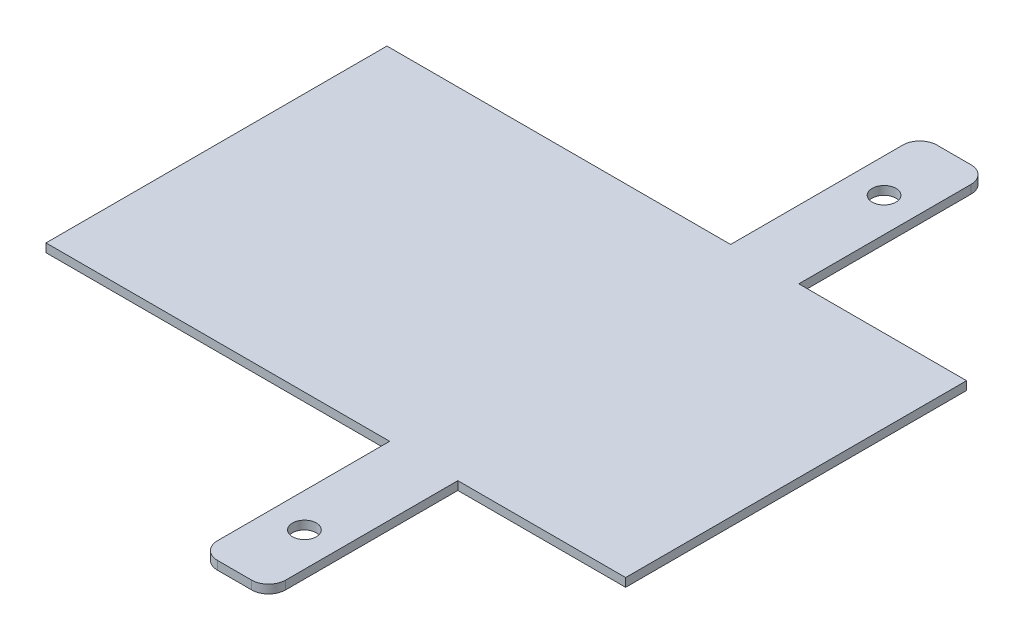
ISO-10303-21;
HEADER;
FILE_DESCRIPTION(('STEP AP214'),'2;1');
FILE_NAME('part.step','',(''),(''),'','','');
FILE_SCHEMA(('AUTOMOTIVE_DESIGN { 1 0 10303 214 1 1 1 1 }'));
ENDSEC;
DATA;
#1=APPLICATION_CONTEXT('core data for automotive mechanical design processes');
#2=APPLICATION_PROTOCOL_DEFINITION('international standard','automotive_design',2000,#1);
#3=PRODUCT_CONTEXT('',#1,'mechanical');
#4=PRODUCT('Part','Part','',(#3));
#5=PRODUCT_RELATED_PRODUCT_CATEGORY('part','',(#4));
#6=PRODUCT_DEFINITION_FORMATION('','',#4);
#7=PRODUCT_DEFINITION_CONTEXT('part definition',#1,'design');
#8=PRODUCT_DEFINITION('design','',#6,#7);
#9=PRODUCT_DEFINITION_SHAPE('','',#8);
#10=(LENGTH_UNIT() NAMED_UNIT(*) SI_UNIT(.MILLI.,.METRE.));
#11=(NAMED_UNIT(*) PLANE_ANGLE_UNIT() SI_UNIT($,.RADIAN.));
#12=(NAMED_UNIT(*) SI_UNIT($,.STERADIAN.) SOLID_ANGLE_UNIT());
#13=UNCERTAINTY_MEASURE_WITH_UNIT(LENGTH_MEASURE(1.E-05),#10,'distance_accuracy_value','');
#14=(GEOMETRIC_REPRESENTATION_CONTEXT(3) GLOBAL_UNCERTAINTY_ASSIGNED_CONTEXT((#13)) GLOBAL_UNIT_ASSIGNED_CONTEXT((#10,
#11,#12)) REPRESENTATION_CONTEXT('',''));
#15=CARTESIAN_POINT('',(0.,0.,0.));
#16=DIRECTION('',(0.,0.,1.));
#17=DIRECTION('',(1.,0.,0.));
#18=AXIS2_PLACEMENT_3D('',#15,#16,#17);
#19=CARTESIAN_POINT('',(-479.708642175763,5.,-121.631578947368));
#20=DIRECTION('',(0.,1.,0.));
#21=DIRECTION('',(0.,0.,1.));
#22=AXIS2_PLACEMENT_3D('',#19,#20,#21);
#23=PLANE('',#22);
#24=CARTESIAN_POINT('',(-469.708642175763,5.,-492.631578947368));
#25=DIRECTION('',(0.,1.,0.));
#26=DIRECTION('',(0.,0.,1.));
#27=AXIS2_PLACEMENT_3D('',#24,#25,#26);
#28=CIRCLE('',#27,6.99999999999999);
#29=CARTESIAN_POINT('',(-469.708642175763,5.,-485.631578947368));
#30=VERTEX_POINT('',#29);
#31=EDGE_CURVE('E187',#30,#30,#28,.T.);
#32=ORIENTED_EDGE('',*,*,#31,.F.);
#33=EDGE_LOOP('',(#32));
#34=FACE_BOUND('',#33,.T.);
#35=DIRECTION('',(0.,0.,1.));
#36=VECTOR('',#35,1.);
#37=CARTESIAN_POINT('',(-691.29647542446,5.,-422.631578947368));
#38=LINE('',#37,#36);
#39=CARTESIAN_POINT('',(-691.29647542446,5.,-422.631578947368));
#40=VERTEX_POINT('',#39);
#41=CARTESIAN_POINT('',(-691.29647542446,5.,-222.631578947368));
#42=VERTEX_POINT('',#41);
#43=EDGE_CURVE('E214',#40,#42,#38,.T.);
#44=ORIENTED_EDGE('',*,*,#43,.T.);
#45=DIRECTION('',(1.,0.,0.));
#46=VECTOR('',#45,1.);
#47=CARTESIAN_POINT('',(-691.29647542446,5.,-222.631578947368));
#48=LINE('',#47,#46);
#49=CARTESIAN_POINT('',(-489.708642175763,5.,-222.631578947368));
#50=VERTEX_POINT('',#49);
#51=EDGE_CURVE('E122',#42,#50,#48,.T.);
#52=ORIENTED_EDGE('',*,*,#51,.T.);
#53=DIRECTION('',(0.,0.,1.));
#54=VECTOR('',#53,1.);
#55=CARTESIAN_POINT('',(-489.708642175763,5.,-222.631578947368));
#56=LINE('',#55,#54);
#57=CARTESIAN_POINT('',(-489.708642175763,5.,-121.631578947368));
#58=VERTEX_POINT('',#57);
#59=EDGE_CURVE('E253',#50,#58,#56,.T.);
#60=ORIENTED_EDGE('',*,*,#59,.T.);
#61=CARTESIAN_POINT('',(-479.708642175763,5.,-121.631578947368));
#62=DIRECTION('',(0.,1.,0.));
#63=DIRECTION('',(0.,0.,1.));
#64=AXIS2_PLACEMENT_3D('',#61,#62,#63);
#65=CIRCLE('',#64,10.);
#66=CARTESIAN_POINT('',(-479.708642175763,5.,-111.631578947368));
#67=VERTEX_POINT('',#66);
#68=EDGE_CURVE('E272',#58,#67,#65,.T.);
#69=ORIENTED_EDGE('',*,*,#68,.T.);
#70=DIRECTION('',(1.,0.,0.));
#71=VECTOR('',#70,1.);
#72=CARTESIAN_POINT('',(-479.708642175763,5.,-111.631578947368));
#73=LINE('',#72,#71);
#74=CARTESIAN_POINT('',(-459.708642175763,5.,-111.631578947369));
#75=VERTEX_POINT('',#74);
#76=EDGE_CURVE('E269',#67,#75,#73,.T.);
#77=ORIENTED_EDGE('',*,*,#76,.T.);
#78=CARTESIAN_POINT('',(-459.708642175763,5.,-121.631578947369));
#79=DIRECTION('',(0.,1.,0.));
#80=DIRECTION('',(0.,0.,1.));
#81=AXIS2_PLACEMENT_3D('',#78,#79,#80);
#82=CIRCLE('',#81,10.);
#83=CARTESIAN_POINT('',(-449.708642175763,5.,-121.631578947369));
#84=VERTEX_POINT('',#83);
#85=EDGE_CURVE('E271',#75,#84,#82,.T.);
#86=ORIENTED_EDGE('',*,*,#85,.T.);
#87=DIRECTION('',(0.,0.,-1.));
#88=VECTOR('',#87,1.);
#89=CARTESIAN_POINT('',(-449.708642175763,5.,-222.631578947368));
#90=LINE('',#89,#88);
#91=CARTESIAN_POINT('',(-449.708642175763,5.,-222.631578947368));
#92=VERTEX_POINT('',#91);
#93=EDGE_CURVE('E274',#84,#92,#90,.T.);
#94=ORIENTED_EDGE('',*,*,#93,.T.);
#95=DIRECTION('',(1.,0.,0.));
#96=VECTOR('',#95,1.);
#97=CARTESIAN_POINT('',(-449.708642175763,5.,-222.631578947368));
#98=LINE('',#97,#96);
#99=CARTESIAN_POINT('',(-351.29647542446,5.,-222.631578947368));
#100=VERTEX_POINT('',#99);
#101=EDGE_CURVE('E280',#92,#100,#98,.T.);
#102=ORIENTED_EDGE('',*,*,#101,.T.);
#103=DIRECTION('',(0.,0.,-1.));
#104=VECTOR('',#103,1.);
#105=CARTESIAN_POINT('',(-351.29647542446,5.,-422.631578947368));
#106=LINE('',#105,#104);
#107=CARTESIAN_POINT('',(-351.29647542446,5.,-422.631578947368));
#108=VERTEX_POINT('',#107);
#109=EDGE_CURVE('E282',#100,#108,#106,.T.);
#110=ORIENTED_EDGE('',*,*,#109,.T.);
#111=DIRECTION('',(-1.,0.,0.));
#112=VECTOR('',#111,1.);
#113=CARTESIAN_POINT('',(-449.708642175763,5.,-422.631578947368));
#114=LINE('',#113,#112);
#115=CARTESIAN_POINT('',(-449.708642175763,5.,-422.631578947368));
#116=VERTEX_POINT('',#115);
#117=EDGE_CURVE('E284',#108,#116,#114,.T.);
#118=ORIENTED_EDGE('',*,*,#117,.T.);
#119=DIRECTION('',(0.,0.,-1.));
#120=VECTOR('',#119,1.);
#121=CARTESIAN_POINT('',(-449.708642175763,5.,-422.631578947368));
#122=LINE('',#121,#120);
#123=CARTESIAN_POINT('',(-449.708642175763,5.,-523.631578947368));
#124=VERTEX_POINT('',#123);
#125=EDGE_CURVE('E286',#116,#124,#122,.T.);
#126=ORIENTED_EDGE('',*,*,#125,.T.);
#127=CARTESIAN_POINT('',(-459.708642175763,5.,-523.631578947368));
#128=DIRECTION('',(0.,1.,0.));
#129=DIRECTION('',(0.,0.,-1.));
#130=AXIS2_PLACEMENT_3D('',#127,#128,#129);
#131=CIRCLE('',#130,10.);
#132=CARTESIAN_POINT('',(-459.708642175763,5.,-533.631578947368));
#133=VERTEX_POINT('',#132);
#134=EDGE_CURVE('E288',#124,#133,#131,.T.);
#135=ORIENTED_EDGE('',*,*,#134,.T.);
#136=DIRECTION('',(-1.,0.,0.));
#137=VECTOR('',#136,1.);
#138=CARTESIAN_POINT('',(-479.708642175763,5.,-533.631578947368));
#139=LINE('',#138,#137);
#140=CARTESIAN_POINT('',(-479.708642175763,5.,-533.631578947368));
#141=VERTEX_POINT('',#140);
#142=EDGE_CURVE('E165',#133,#141,#139,.T.);
#143=ORIENTED_EDGE('',*,*,#142,.T.);
#144=CARTESIAN_POINT('',(-479.708642175763,5.,-523.631578947368));
#145=DIRECTION('',(0.,1.,0.));
#146=DIRECTION('',(0.,0.,-1.));
#147=AXIS2_PLACEMENT_3D('',#144,#145,#146);
#148=CIRCLE('',#147,10.);
#149=CARTESIAN_POINT('',(-489.708642175763,5.,-523.631578947368));
#150=VERTEX_POINT('',#149);
#151=EDGE_CURVE('E159',#141,#150,#148,.T.);
#152=ORIENTED_EDGE('',*,*,#151,.T.);
#153=DIRECTION('',(0.,0.,1.));
#154=VECTOR('',#153,1.);
#155=CARTESIAN_POINT('',(-489.708642175763,5.,-422.631578947368));
#156=LINE('',#155,#154);
#157=CARTESIAN_POINT('',(-489.708642175763,5.,-422.631578947368));
#158=VERTEX_POINT('',#157);
#159=EDGE_CURVE('E163',#150,#158,#156,.T.);
#160=ORIENTED_EDGE('',*,*,#159,.T.);
#161=DIRECTION('',(-1.,0.,0.));
#162=VECTOR('',#161,1.);
#163=CARTESIAN_POINT('',(-691.29647542446,5.,-422.631578947368));
#164=LINE('',#163,#162);
#165=EDGE_CURVE('E55',#158,#40,#164,.T.);
#166=ORIENTED_EDGE('',*,*,#165,.T.);
#167=EDGE_LOOP('',(#44,#52,#60,#69,#77,#86,#94,#102,#110,#118,#126,#135,#143,#152,#160,#166));
#168=FACE_BOUND('',#167,.T.);
#169=CARTESIAN_POINT('',(-469.708642175763,5.,-152.631578947368));
#170=DIRECTION('',(0.,1.,0.));
#171=DIRECTION('',(0.,0.,1.));
#172=AXIS2_PLACEMENT_3D('',#169,#170,#171);
#173=CIRCLE('',#172,6.99999999999999);
#174=CARTESIAN_POINT('',(-469.708642175763,5.,-145.631578947368));
#175=VERTEX_POINT('',#174);
#176=EDGE_CURVE('E330',#175,#175,#173,.T.);
#177=ORIENTED_EDGE('',*,*,#176,.F.);
#178=EDGE_LOOP('',(#177));
#179=FACE_BOUND('',#178,.T.);
#180=ADVANCED_FACE('F38',(#34,#168,#179),#23,.T.);
#181=CARTESIAN_POINT('',(-479.708642175763,0.,-121.631578947368));
#182=DIRECTION('',(0.,1.,0.));
#183=DIRECTION('',(0.,0.,1.));
#184=AXIS2_PLACEMENT_3D('',#181,#182,#183);
#185=PLANE('',#184);
#186=DIRECTION('',(0.,0.,1.));
#187=VECTOR('',#186,1.);
#188=CARTESIAN_POINT('',(-691.29647542446,0.,-422.631578947368));
#189=LINE('',#188,#187);
#190=CARTESIAN_POINT('',(-691.29647542446,0.,-422.631578947368));
#191=VERTEX_POINT('',#190);
#192=CARTESIAN_POINT('',(-691.29647542446,0.,-222.631578947368));
#193=VERTEX_POINT('',#192);
#194=EDGE_CURVE('E183',#191,#193,#189,.T.);
#195=ORIENTED_EDGE('',*,*,#194,.F.);
#196=DIRECTION('',(-1.,0.,0.));
#197=VECTOR('',#196,1.);
#198=CARTESIAN_POINT('',(-691.29647542446,0.,-422.631578947368));
#199=LINE('',#198,#197);
#200=CARTESIAN_POINT('',(-489.708642175763,0.,-422.631578947368));
#201=VERTEX_POINT('',#200);
#202=EDGE_CURVE('E114',#201,#191,#199,.T.);
#203=ORIENTED_EDGE('',*,*,#202,.F.);
#204=DIRECTION('',(0.,0.,1.));
#205=VECTOR('',#204,1.);
#206=CARTESIAN_POINT('',(-489.708642175763,0.,-422.631578947368));
#207=LINE('',#206,#205);
#208=CARTESIAN_POINT('',(-489.708642175763,0.,-523.631578947368));
#209=VERTEX_POINT('',#208);
#210=EDGE_CURVE('E108',#209,#201,#207,.T.);
#211=ORIENTED_EDGE('',*,*,#210,.F.);
#212=CARTESIAN_POINT('',(-479.708642175763,0.,-523.631578947368));
#213=DIRECTION('',(0.,1.,0.));
#214=DIRECTION('',(0.,0.,-1.));
#215=AXIS2_PLACEMENT_3D('',#212,#213,#214);
#216=CIRCLE('',#215,10.);
#217=CARTESIAN_POINT('',(-479.708642175763,0.,-533.631578947368));
#218=VERTEX_POINT('',#217);
#219=EDGE_CURVE('E173',#218,#209,#216,.T.);
#220=ORIENTED_EDGE('',*,*,#219,.F.);
#221=DIRECTION('',(-1.,0.,0.));
#222=VECTOR('',#221,1.);
#223=CARTESIAN_POINT('',(-479.708642175763,0.,-533.631578947368));
#224=LINE('',#223,#222);
#225=CARTESIAN_POINT('',(-459.708642175763,0.,-533.631578947368));
#226=VERTEX_POINT('',#225);
#227=EDGE_CURVE('E209',#226,#218,#224,.T.);
#228=ORIENTED_EDGE('',*,*,#227,.F.);
#229=CARTESIAN_POINT('',(-459.708642175763,0.,-523.631578947368));
#230=DIRECTION('',(0.,1.,0.));
#231=DIRECTION('',(0.,0.,-1.));
#232=AXIS2_PLACEMENT_3D('',#229,#230,#231);
#233=CIRCLE('',#232,10.);
#234=CARTESIAN_POINT('',(-449.708642175763,0.,-523.631578947368));
#235=VERTEX_POINT('',#234);
#236=EDGE_CURVE('E207',#235,#226,#233,.T.);
#237=ORIENTED_EDGE('',*,*,#236,.F.);
#238=DIRECTION('',(0.,0.,-1.));
#239=VECTOR('',#238,1.);
#240=CARTESIAN_POINT('',(-449.708642175763,0.,-422.631578947368));
#241=LINE('',#240,#239);
#242=CARTESIAN_POINT('',(-449.708642175763,0.,-422.631578947368));
#243=VERTEX_POINT('',#242);
#244=EDGE_CURVE('E205',#243,#235,#241,.T.);
#245=ORIENTED_EDGE('',*,*,#244,.F.);
#246=DIRECTION('',(-1.,0.,0.));
#247=VECTOR('',#246,1.);
#248=CARTESIAN_POINT('',(-449.708642175763,0.,-422.631578947368));
#249=LINE('',#248,#247);
#250=CARTESIAN_POINT('',(-351.29647542446,0.,-422.631578947368));
#251=VERTEX_POINT('',#250);
#252=EDGE_CURVE('E203',#251,#243,#249,.T.);
#253=ORIENTED_EDGE('',*,*,#252,.F.);
#254=DIRECTION('',(0.,0.,-1.));
#255=VECTOR('',#254,1.);
#256=CARTESIAN_POINT('',(-351.29647542446,0.,-422.631578947368));
#257=LINE('',#256,#255);
#258=CARTESIAN_POINT('',(-351.29647542446,0.,-222.631578947368));
#259=VERTEX_POINT('',#258);
#260=EDGE_CURVE('E201',#259,#251,#257,.T.);
#261=ORIENTED_EDGE('',*,*,#260,.F.);
#262=DIRECTION('',(1.,0.,0.));
#263=VECTOR('',#262,1.);
#264=CARTESIAN_POINT('',(-449.708642175763,0.,-222.631578947368));
#265=LINE('',#264,#263);
#266=CARTESIAN_POINT('',(-449.708642175763,0.,-222.631578947368));
#267=VERTEX_POINT('',#266);
#268=EDGE_CURVE('E199',#267,#259,#265,.T.);
#269=ORIENTED_EDGE('',*,*,#268,.F.);
#270=DIRECTION('',(0.,0.,-1.));
#271=VECTOR('',#270,1.);
#272=CARTESIAN_POINT('',(-449.708642175763,0.,-222.631578947368));
#273=LINE('',#272,#271);
#274=CARTESIAN_POINT('',(-449.708642175763,0.,-121.631578947369));
#275=VERTEX_POINT('',#274);
#276=EDGE_CURVE('E197',#275,#267,#273,.T.);
#277=ORIENTED_EDGE('',*,*,#276,.F.);
#278=CARTESIAN_POINT('',(-459.708642175763,0.,-121.631578947369));
#279=DIRECTION('',(0.,1.,0.));
#280=DIRECTION('',(0.,0.,1.));
#281=AXIS2_PLACEMENT_3D('',#278,#279,#280);
#282=CIRCLE('',#281,10.);
#283=CARTESIAN_POINT('',(-459.708642175763,0.,-111.631578947369));
#284=VERTEX_POINT('',#283);
#285=EDGE_CURVE('E195',#284,#275,#282,.T.);
#286=ORIENTED_EDGE('',*,*,#285,.F.);
#287=DIRECTION('',(1.,0.,0.));
#288=VECTOR('',#287,1.);
#289=CARTESIAN_POINT('',(-479.708642175763,0.,-111.631578947368));
#290=LINE('',#289,#288);
#291=CARTESIAN_POINT('',(-479.708642175763,0.,-111.631578947368));
#292=VERTEX_POINT('',#291);
#293=EDGE_CURVE('E193',#292,#284,#290,.T.);
#294=ORIENTED_EDGE('',*,*,#293,.F.);
#295=CARTESIAN_POINT('',(-479.708642175763,0.,-121.631578947368));
#296=DIRECTION('',(0.,1.,0.));
#297=DIRECTION('',(0.,0.,1.));
#298=AXIS2_PLACEMENT_3D('',#295,#296,#297);
#299=CIRCLE('',#298,10.);
#300=CARTESIAN_POINT('',(-489.708642175763,0.,-121.631578947368));
#301=VERTEX_POINT('',#300);
#302=EDGE_CURVE('E191',#301,#292,#299,.T.);
#303=ORIENTED_EDGE('',*,*,#302,.F.);
#304=DIRECTION('',(0.,0.,1.));
#305=VECTOR('',#304,1.);
#306=CARTESIAN_POINT('',(-489.708642175763,0.,-222.631578947368));
#307=LINE('',#306,#305);
#308=CARTESIAN_POINT('',(-489.708642175763,0.,-222.631578947368));
#309=VERTEX_POINT('',#308);
#310=EDGE_CURVE('E189',#309,#301,#307,.T.);
#311=ORIENTED_EDGE('',*,*,#310,.F.);
#312=DIRECTION('',(1.,0.,0.));
#313=VECTOR('',#312,1.);
#314=CARTESIAN_POINT('',(-691.29647542446,0.,-222.631578947368));
#315=LINE('',#314,#313);
#316=EDGE_CURVE('E186',#193,#309,#315,.T.);
#317=ORIENTED_EDGE('',*,*,#316,.F.);
#318=EDGE_LOOP('',(#195,#203,#211,#220,#228,#237,#245,#253,#261,#269,#277,#286,#294,#303,#311,#317));
#319=FACE_BOUND('',#318,.T.);
#320=CARTESIAN_POINT('',(-469.708642175763,0.,-492.631578947368));
#321=DIRECTION('',(0.,1.,0.));
#322=DIRECTION('',(0.,0.,1.));
#323=AXIS2_PLACEMENT_3D('',#320,#321,#322);
#324=CIRCLE('',#323,6.99999999999999);
#325=CARTESIAN_POINT('',(-469.708642175763,0.,-485.631578947368));
#326=VERTEX_POINT('',#325);
#327=EDGE_CURVE('E336',#326,#326,#324,.T.);
#328=ORIENTED_EDGE('',*,*,#327,.T.);
#329=EDGE_LOOP('',(#328));
#330=FACE_BOUND('',#329,.T.);
#331=CARTESIAN_POINT('',(-469.708642175763,0.,-152.631578947368));
#332=DIRECTION('',(0.,1.,0.));
#333=DIRECTION('',(0.,0.,1.));
#334=AXIS2_PLACEMENT_3D('',#331,#332,#333);
#335=CIRCLE('',#334,6.99999999999999);
#336=CARTESIAN_POINT('',(-469.708642175763,0.,-145.631578947368));
#337=VERTEX_POINT('',#336);
#338=EDGE_CURVE('E333',#337,#337,#335,.T.);
#339=ORIENTED_EDGE('',*,*,#338,.T.);
#340=EDGE_LOOP('',(#339));
#341=FACE_BOUND('',#340,.T.);
#342=ADVANCED_FACE('F257',(#319,#330,#341),#185,.F.);
#343=CARTESIAN_POINT('',(-691.29647542446,5.,-422.631578947368));
#344=DIRECTION('',(1.,0.,0.));
#345=DIRECTION('',(0.,0.,-1.));
#346=AXIS2_PLACEMENT_3D('',#343,#344,#345);
#347=PLANE('',#346);
#348=ORIENTED_EDGE('',*,*,#194,.T.);
#349=DIRECTION('',(0.,-1.,0.));
#350=VECTOR('',#349,1.);
#351=CARTESIAN_POINT('',(-691.29647542446,5.,-222.631578947368));
#352=LINE('',#351,#350);
#353=EDGE_CURVE('E11',#42,#193,#352,.T.);
#354=ORIENTED_EDGE('',*,*,#353,.F.);
#355=ORIENTED_EDGE('',*,*,#43,.F.);
#356=DIRECTION('',(0.,-1.,0.));
#357=VECTOR('',#356,1.);
#358=CARTESIAN_POINT('',(-691.29647542446,5.,-422.631578947368));
#359=LINE('',#358,#357);
#360=EDGE_CURVE('E179',#40,#191,#359,.T.);
#361=ORIENTED_EDGE('',*,*,#360,.T.);
#362=EDGE_LOOP('',(#348,#354,#355,#361));
#363=FACE_BOUND('',#362,.T.);
#364=ADVANCED_FACE('F40',(#363),#347,.F.);
#365=CARTESIAN_POINT('',(-691.29647542446,5.,-222.631578947368));
#366=DIRECTION('',(0.,0.,-1.));
#367=DIRECTION('',(-1.,0.,0.));
#368=AXIS2_PLACEMENT_3D('',#365,#366,#367);
#369=PLANE('',#368);
#370=ORIENTED_EDGE('',*,*,#316,.T.);
#371=DIRECTION('',(0.,-1.,0.));
#372=VECTOR('',#371,1.);
#373=CARTESIAN_POINT('',(-489.708642175763,5.,-222.631578947368));
#374=LINE('',#373,#372);
#375=EDGE_CURVE('E47',#50,#309,#374,.T.);
#376=ORIENTED_EDGE('',*,*,#375,.F.);
#377=ORIENTED_EDGE('',*,*,#51,.F.);
#378=ORIENTED_EDGE('',*,*,#353,.T.);
#379=EDGE_LOOP('',(#370,#376,#377,#378));
#380=FACE_BOUND('',#379,.T.);
#381=ADVANCED_FACE('F469',(#380),#369,.F.);
#382=CARTESIAN_POINT('',(-489.708642175763,5.,-222.631578947368));
#383=DIRECTION('',(1.,0.,0.));
#384=DIRECTION('',(0.,0.,-1.));
#385=AXIS2_PLACEMENT_3D('',#382,#383,#384);
#386=PLANE('',#385);
#387=ORIENTED_EDGE('',*,*,#310,.T.);
#388=DIRECTION('',(0.,-1.,0.));
#389=VECTOR('',#388,1.);
#390=CARTESIAN_POINT('',(-489.708642175763,5.,-121.631578947368));
#391=LINE('',#390,#389);
#392=EDGE_CURVE('E245',#58,#301,#391,.T.);
#393=ORIENTED_EDGE('',*,*,#392,.F.);
#394=ORIENTED_EDGE('',*,*,#59,.F.);
#395=ORIENTED_EDGE('',*,*,#375,.T.);
#396=EDGE_LOOP('',(#387,#393,#394,#395));
#397=FACE_BOUND('',#396,.T.);
#398=ADVANCED_FACE('F251',(#397),#386,.F.);
#399=CARTESIAN_POINT('',(-479.708642175763,5.,-121.631578947368));
#400=DIRECTION('',(0.,-1.,0.));
#401=DIRECTION('',(0.,0.,-1.));
#402=AXIS2_PLACEMENT_3D('',#399,#400,#401);
#403=CYLINDRICAL_SURFACE('',#402,10.);
#404=ORIENTED_EDGE('',*,*,#302,.T.);
#405=DIRECTION('',(0.,-1.,0.));
#406=VECTOR('',#405,1.);
#407=CARTESIAN_POINT('',(-479.708642175763,5.,-111.631578947368));
#408=LINE('',#407,#406);
#409=EDGE_CURVE('E242',#67,#292,#408,.T.);
#410=ORIENTED_EDGE('',*,*,#409,.F.);
#411=ORIENTED_EDGE('',*,*,#68,.F.);
#412=ORIENTED_EDGE('',*,*,#392,.T.);
#413=EDGE_LOOP('',(#404,#410,#411,#412));
#414=FACE_BOUND('',#413,.T.);
#415=ADVANCED_FACE('F263',(#414),#403,.T.);
#416=CARTESIAN_POINT('',(-479.708642175763,5.,-111.631578947368));
#417=DIRECTION('',(0.,0.,-1.));
#418=DIRECTION('',(-1.,0.,0.));
#419=AXIS2_PLACEMENT_3D('',#416,#417,#418);
#420=PLANE('',#419);
#421=ORIENTED_EDGE('',*,*,#293,.T.);
#422=DIRECTION('',(0.,-1.,0.));
#423=VECTOR('',#422,1.);
#424=CARTESIAN_POINT('',(-459.708642175763,5.,-111.631578947369));
#425=LINE('',#424,#423);
#426=EDGE_CURVE('E239',#75,#284,#425,.T.);
#427=ORIENTED_EDGE('',*,*,#426,.F.);
#428=ORIENTED_EDGE('',*,*,#76,.F.);
#429=ORIENTED_EDGE('',*,*,#409,.T.);
#430=EDGE_LOOP('',(#421,#427,#428,#429));
#431=FACE_BOUND('',#430,.T.);
#432=ADVANCED_FACE('F267',(#431),#420,.F.);
#433=CARTESIAN_POINT('',(-459.708642175763,5.,-121.631578947369));
#434=DIRECTION('',(0.,-1.,0.));
#435=DIRECTION('',(0.,0.,-1.));
#436=AXIS2_PLACEMENT_3D('',#433,#434,#435);
#437=CYLINDRICAL_SURFACE('',#436,10.);
#438=ORIENTED_EDGE('',*,*,#285,.T.);
#439=DIRECTION('',(0.,-1.,0.));
#440=VECTOR('',#439,1.);
#441=CARTESIAN_POINT('',(-449.708642175763,5.,-121.631578947369));
#442=LINE('',#441,#440);
#443=EDGE_CURVE('E236',#84,#275,#442,.T.);
#444=ORIENTED_EDGE('',*,*,#443,.F.);
#445=ORIENTED_EDGE('',*,*,#85,.F.);
#446=ORIENTED_EDGE('',*,*,#426,.T.);
#447=EDGE_LOOP('',(#438,#444,#445,#446));
#448=FACE_BOUND('',#447,.T.);
#449=ADVANCED_FACE('F434',(#448),#437,.T.);
#450=CARTESIAN_POINT('',(-449.708642175763,5.,-222.631578947368));
#451=DIRECTION('',(-1.,0.,0.));
#452=DIRECTION('',(0.,0.,1.));
#453=AXIS2_PLACEMENT_3D('',#450,#451,#452);
#454=PLANE('',#453);
#455=ORIENTED_EDGE('',*,*,#276,.T.);
#456=DIRECTION('',(0.,-1.,0.));
#457=VECTOR('',#456,1.);
#458=CARTESIAN_POINT('',(-449.708642175763,5.,-222.631578947368));
#459=LINE('',#458,#457);
#460=EDGE_CURVE('E233',#92,#267,#459,.T.);
#461=ORIENTED_EDGE('',*,*,#460,.F.);
#462=ORIENTED_EDGE('',*,*,#93,.F.);
#463=ORIENTED_EDGE('',*,*,#443,.T.);
#464=EDGE_LOOP('',(#455,#461,#462,#463));
#465=FACE_BOUND('',#464,.T.);
#466=ADVANCED_FACE('F424',(#465),#454,.F.);
#467=CARTESIAN_POINT('',(-449.708642175763,5.,-222.631578947368));
#468=DIRECTION('',(0.,0.,-1.));
#469=DIRECTION('',(-1.,0.,0.));
#470=AXIS2_PLACEMENT_3D('',#467,#468,#469);
#471=PLANE('',#470);
#472=ORIENTED_EDGE('',*,*,#268,.T.);
#473=DIRECTION('',(0.,-1.,0.));
#474=VECTOR('',#473,1.);
#475=CARTESIAN_POINT('',(-351.29647542446,5.,-222.631578947368));
#476=LINE('',#475,#474);
#477=EDGE_CURVE('E230',#100,#259,#476,.T.);
#478=ORIENTED_EDGE('',*,*,#477,.F.);
#479=ORIENTED_EDGE('',*,*,#101,.F.);
#480=ORIENTED_EDGE('',*,*,#460,.T.);
#481=EDGE_LOOP('',(#472,#478,#479,#480));
#482=FACE_BOUND('',#481,.T.);
#483=ADVANCED_FACE('F414',(#482),#471,.F.);
#484=CARTESIAN_POINT('',(-351.29647542446,5.,-422.631578947368));
#485=DIRECTION('',(-1.,0.,0.));
#486=DIRECTION('',(0.,0.,1.));
#487=AXIS2_PLACEMENT_3D('',#484,#485,#486);
#488=PLANE('',#487);
#489=ORIENTED_EDGE('',*,*,#260,.T.);
#490=DIRECTION('',(0.,-1.,0.));
#491=VECTOR('',#490,1.);
#492=CARTESIAN_POINT('',(-351.29647542446,5.,-422.631578947368));
#493=LINE('',#492,#491);
#494=EDGE_CURVE('E227',#108,#251,#493,.T.);
#495=ORIENTED_EDGE('',*,*,#494,.F.);
#496=ORIENTED_EDGE('',*,*,#109,.F.);
#497=ORIENTED_EDGE('',*,*,#477,.T.);
#498=EDGE_LOOP('',(#489,#495,#496,#497));
#499=FACE_BOUND('',#498,.T.);
#500=ADVANCED_FACE('F404',(#499),#488,.F.);
#501=CARTESIAN_POINT('',(-449.708642175763,5.,-422.631578947368));
#502=DIRECTION('',(0.,0.,1.));
#503=DIRECTION('',(1.,0.,0.));
#504=AXIS2_PLACEMENT_3D('',#501,#502,#503);
#505=PLANE('',#504);
#506=ORIENTED_EDGE('',*,*,#252,.T.);
#507=DIRECTION('',(0.,-1.,0.));
#508=VECTOR('',#507,1.);
#509=CARTESIAN_POINT('',(-449.708642175763,5.,-422.631578947368));
#510=LINE('',#509,#508);
#511=EDGE_CURVE('E224',#116,#243,#510,.T.);
#512=ORIENTED_EDGE('',*,*,#511,.F.);
#513=ORIENTED_EDGE('',*,*,#117,.F.);
#514=ORIENTED_EDGE('',*,*,#494,.T.);
#515=EDGE_LOOP('',(#506,#512,#513,#514));
#516=FACE_BOUND('',#515,.T.);
#517=ADVANCED_FACE('F394',(#516),#505,.F.);
#518=CARTESIAN_POINT('',(-449.708642175763,5.,-422.631578947368));
#519=DIRECTION('',(-1.,0.,0.));
#520=DIRECTION('',(0.,0.,1.));
#521=AXIS2_PLACEMENT_3D('',#518,#519,#520);
#522=PLANE('',#521);
#523=ORIENTED_EDGE('',*,*,#244,.T.);
#524=DIRECTION('',(0.,-1.,0.));
#525=VECTOR('',#524,1.);
#526=CARTESIAN_POINT('',(-449.708642175763,5.,-523.631578947368));
#527=LINE('',#526,#525);
#528=EDGE_CURVE('E221',#124,#235,#527,.T.);
#529=ORIENTED_EDGE('',*,*,#528,.F.);
#530=ORIENTED_EDGE('',*,*,#125,.F.);
#531=ORIENTED_EDGE('',*,*,#511,.T.);
#532=EDGE_LOOP('',(#523,#529,#530,#531));
#533=FACE_BOUND('',#532,.T.);
#534=ADVANCED_FACE('F385',(#533),#522,.F.);
#535=CARTESIAN_POINT('',(-459.708642175763,5.,-523.631578947368));
#536=DIRECTION('',(0.,-1.,0.));
#537=DIRECTION('',(0.,0.,-1.));
#538=AXIS2_PLACEMENT_3D('',#535,#536,#537);
#539=CYLINDRICAL_SURFACE('',#538,10.);
#540=ORIENTED_EDGE('',*,*,#236,.T.);
#541=DIRECTION('',(0.,-1.,0.));
#542=VECTOR('',#541,1.);
#543=CARTESIAN_POINT('',(-459.708642175763,5.,-533.631578947368));
#544=LINE('',#543,#542);
#545=EDGE_CURVE('E218',#133,#226,#544,.T.);
#546=ORIENTED_EDGE('',*,*,#545,.F.);
#547=ORIENTED_EDGE('',*,*,#134,.F.);
#548=ORIENTED_EDGE('',*,*,#528,.T.);
#549=EDGE_LOOP('',(#540,#546,#547,#548));
#550=FACE_BOUND('',#549,.T.);
#551=ADVANCED_FACE('F294',(#550),#539,.T.);
#552=CARTESIAN_POINT('',(-479.708642175763,5.,-533.631578947368));
#553=DIRECTION('',(0.,0.,1.));
#554=DIRECTION('',(1.,0.,0.));
#555=AXIS2_PLACEMENT_3D('',#552,#553,#554);
#556=PLANE('',#555);
#557=ORIENTED_EDGE('',*,*,#227,.T.);
#558=DIRECTION('',(0.,-1.,0.));
#559=VECTOR('',#558,1.);
#560=CARTESIAN_POINT('',(-479.708642175763,5.,-533.631578947368));
#561=LINE('',#560,#559);
#562=EDGE_CURVE('E174',#141,#218,#561,.T.);
#563=ORIENTED_EDGE('',*,*,#562,.F.);
#564=ORIENTED_EDGE('',*,*,#142,.F.);
#565=ORIENTED_EDGE('',*,*,#545,.T.);
#566=EDGE_LOOP('',(#557,#563,#564,#565));
#567=FACE_BOUND('',#566,.T.);
#568=ADVANCED_FACE('F298',(#567),#556,.F.);
#569=CARTESIAN_POINT('',(-479.708642175763,5.,-523.631578947368));
#570=DIRECTION('',(0.,-1.,0.));
#571=DIRECTION('',(0.,0.,-1.));
#572=AXIS2_PLACEMENT_3D('',#569,#570,#571);
#573=CYLINDRICAL_SURFACE('',#572,10.);
#574=ORIENTED_EDGE('',*,*,#219,.T.);
#575=DIRECTION('',(0.,-1.,0.));
#576=VECTOR('',#575,1.);
#577=CARTESIAN_POINT('',(-489.708642175763,5.,-523.631578947368));
#578=LINE('',#577,#576);
#579=EDGE_CURVE('E170',#150,#209,#578,.T.);
#580=ORIENTED_EDGE('',*,*,#579,.F.);
#581=ORIENTED_EDGE('',*,*,#151,.F.);
#582=ORIENTED_EDGE('',*,*,#562,.T.);
#583=EDGE_LOOP('',(#574,#580,#581,#582));
#584=FACE_BOUND('',#583,.T.);
#585=ADVANCED_FACE('F171',(#584),#573,.T.);
#586=CARTESIAN_POINT('',(-489.708642175763,5.,-422.631578947368));
#587=DIRECTION('',(1.,0.,0.));
#588=DIRECTION('',(0.,0.,-1.));
#589=AXIS2_PLACEMENT_3D('',#586,#587,#588);
#590=PLANE('',#589);
#591=ORIENTED_EDGE('',*,*,#210,.T.);
#592=DIRECTION('',(0.,-1.,0.));
#593=VECTOR('',#592,1.);
#594=CARTESIAN_POINT('',(-489.708642175763,5.,-422.631578947368));
#595=LINE('',#594,#593);
#596=EDGE_CURVE('E175',#158,#201,#595,.T.);
#597=ORIENTED_EDGE('',*,*,#596,.F.);
#598=ORIENTED_EDGE('',*,*,#159,.F.);
#599=ORIENTED_EDGE('',*,*,#579,.T.);
#600=EDGE_LOOP('',(#591,#597,#598,#599));
#601=FACE_BOUND('',#600,.T.);
#602=ADVANCED_FACE('F177',(#601),#590,.F.);
#603=CARTESIAN_POINT('',(-691.29647542446,5.,-422.631578947368));
#604=DIRECTION('',(0.,0.,1.));
#605=DIRECTION('',(1.,0.,0.));
#606=AXIS2_PLACEMENT_3D('',#603,#604,#605);
#607=PLANE('',#606);
#608=ORIENTED_EDGE('',*,*,#202,.T.);
#609=ORIENTED_EDGE('',*,*,#360,.F.);
#610=ORIENTED_EDGE('',*,*,#165,.F.);
#611=ORIENTED_EDGE('',*,*,#596,.T.);
#612=EDGE_LOOP('',(#608,#609,#610,#611));
#613=FACE_BOUND('',#612,.T.);
#614=ADVANCED_FACE('F302',(#613),#607,.F.);
#615=CARTESIAN_POINT('',(-469.708642175763,5.,-492.631578947368));
#616=DIRECTION('',(0.,-1.,0.));
#617=DIRECTION('',(0.,0.,-1.));
#618=AXIS2_PLACEMENT_3D('',#615,#616,#617);
#619=CYLINDRICAL_SURFACE('',#618,6.99999999999999);
#620=ORIENTED_EDGE('',*,*,#31,.T.);
#621=EDGE_LOOP('',(#620));
#622=FACE_BOUND('',#621,.T.);
#623=ORIENTED_EDGE('',*,*,#327,.F.);
#624=EDGE_LOOP('',(#623));
#625=FACE_BOUND('',#624,.T.);
#626=ADVANCED_FACE('F304',(#622,#625),#619,.F.);
#627=CARTESIAN_POINT('',(-469.708642175763,5.,-152.631578947368));
#628=DIRECTION('',(0.,-1.,0.));
#629=DIRECTION('',(0.,0.,-1.));
#630=AXIS2_PLACEMENT_3D('',#627,#628,#629);
#631=CYLINDRICAL_SURFACE('',#630,6.99999999999999);
#632=ORIENTED_EDGE('',*,*,#176,.T.);
#633=EDGE_LOOP('',(#632));
#634=FACE_BOUND('',#633,.T.);
#635=ORIENTED_EDGE('',*,*,#338,.F.);
#636=EDGE_LOOP('',(#635));
#637=FACE_BOUND('',#636,.T.);
#638=ADVANCED_FACE('F310',(#634,#637),#631,.F.);
#639=CLOSED_SHELL('',(#180,#342,#364,#381,#398,#415,#432,#449,#466,#483,#500,#517,#534,#551,
#568,#585,#602,#614,#626,#638));
#640=MANIFOLD_SOLID_BREP('B2',#639);
#641=ADVANCED_BREP_SHAPE_REPRESENTATION('',(#18,#640),#14);
#642=SHAPE_DEFINITION_REPRESENTATION(#9,#641);
ENDSEC;
END-ISO-10303-21;
